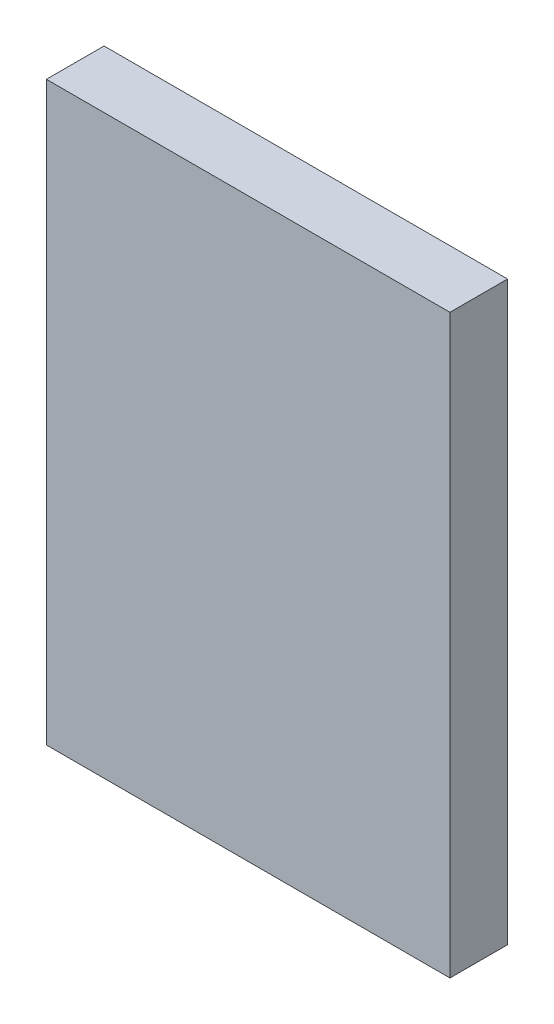
ISO-10303-21;
HEADER;
FILE_DESCRIPTION(('STEP AP214'),'2;1');
FILE_NAME('part.step','',(''),(''),'','','');
FILE_SCHEMA(('AUTOMOTIVE_DESIGN { 1 0 10303 214 1 1 1 1 }'));
ENDSEC;
DATA;
#1=APPLICATION_CONTEXT('core data for automotive mechanical design processes');
#2=APPLICATION_PROTOCOL_DEFINITION('international standard','automotive_design',2000,#1);
#3=PRODUCT_CONTEXT('',#1,'mechanical');
#4=PRODUCT('Part','Part','',(#3));
#5=PRODUCT_RELATED_PRODUCT_CATEGORY('part','',(#4));
#6=PRODUCT_DEFINITION_FORMATION('','',#4);
#7=PRODUCT_DEFINITION_CONTEXT('part definition',#1,'design');
#8=PRODUCT_DEFINITION('design','',#6,#7);
#9=PRODUCT_DEFINITION_SHAPE('','',#8);
#10=(LENGTH_UNIT() NAMED_UNIT(*) SI_UNIT(.MILLI.,.METRE.));
#11=(NAMED_UNIT(*) PLANE_ANGLE_UNIT() SI_UNIT($,.RADIAN.));
#12=(NAMED_UNIT(*) SI_UNIT($,.STERADIAN.) SOLID_ANGLE_UNIT());
#13=UNCERTAINTY_MEASURE_WITH_UNIT(LENGTH_MEASURE(1.E-05),#10,'distance_accuracy_value','');
#14=(GEOMETRIC_REPRESENTATION_CONTEXT(3) GLOBAL_UNCERTAINTY_ASSIGNED_CONTEXT((#13)) GLOBAL_UNIT_ASSIGNED_CONTEXT((#10,
#11,#12)) REPRESENTATION_CONTEXT('',''));
#15=CARTESIAN_POINT('',(0.,0.,0.));
#16=DIRECTION('',(0.,0.,1.));
#17=DIRECTION('',(1.,0.,0.));
#18=AXIS2_PLACEMENT_3D('',#15,#16,#17);
#19=CARTESIAN_POINT('',(350.,500.,50.));
#20=DIRECTION('',(-1.,0.,0.));
#21=DIRECTION('',(0.,-1.,0.));
#22=AXIS2_PLACEMENT_3D('',#19,#20,#21);
#23=PLANE('',#22);
#24=DIRECTION('',(0.,1.,0.));
#25=VECTOR('',#24,1.);
#26=CARTESIAN_POINT('',(350.,500.,-50.));
#27=LINE('',#26,#25);
#28=CARTESIAN_POINT('',(350.,-500.,-50.));
#29=VERTEX_POINT('',#28);
#30=CARTESIAN_POINT('',(350.,500.,-50.));
#31=VERTEX_POINT('',#30);
#32=EDGE_CURVE('E96',#29,#31,#27,.T.);
#33=ORIENTED_EDGE('',*,*,#32,.T.);
#34=DIRECTION('',(0.,0.,-1.));
#35=VECTOR('',#34,1.);
#36=CARTESIAN_POINT('',(350.,500.,50.));
#37=LINE('',#36,#35);
#38=CARTESIAN_POINT('',(350.,500.,50.));
#39=VERTEX_POINT('',#38);
#40=EDGE_CURVE('E11',#39,#31,#37,.T.);
#41=ORIENTED_EDGE('',*,*,#40,.F.);
#42=DIRECTION('',(0.,1.,0.));
#43=VECTOR('',#42,1.);
#44=CARTESIAN_POINT('',(350.,500.,50.));
#45=LINE('',#44,#43);
#46=CARTESIAN_POINT('',(350.,-500.,50.));
#47=VERTEX_POINT('',#46);
#48=EDGE_CURVE('E84',#47,#39,#45,.T.);
#49=ORIENTED_EDGE('',*,*,#48,.F.);
#50=DIRECTION('',(0.,0.,-1.));
#51=VECTOR('',#50,1.);
#52=CARTESIAN_POINT('',(350.,-500.,50.));
#53=LINE('',#52,#51);
#54=EDGE_CURVE('E92',#47,#29,#53,.T.);
#55=ORIENTED_EDGE('',*,*,#54,.T.);
#56=EDGE_LOOP('',(#33,#41,#49,#55));
#57=FACE_BOUND('',#56,.T.);
#58=ADVANCED_FACE('F33',(#57),#23,.F.);
#59=CARTESIAN_POINT('',(-350.,500.,50.));
#60=DIRECTION('',(0.,-1.,0.));
#61=DIRECTION('',(0.,0.,-1.));
#62=AXIS2_PLACEMENT_3D('',#59,#60,#61);
#63=PLANE('',#62);
#64=DIRECTION('',(-1.,0.,0.));
#65=VECTOR('',#64,1.);
#66=CARTESIAN_POINT('',(-350.,500.,-50.));
#67=LINE('',#66,#65);
#68=CARTESIAN_POINT('',(-350.,500.,-50.));
#69=VERTEX_POINT('',#68);
#70=EDGE_CURVE('E88',#31,#69,#67,.T.);
#71=ORIENTED_EDGE('',*,*,#70,.T.);
#72=DIRECTION('',(0.,0.,-1.));
#73=VECTOR('',#72,1.);
#74=CARTESIAN_POINT('',(-350.,500.,50.));
#75=LINE('',#74,#73);
#76=CARTESIAN_POINT('',(-350.,500.,50.));
#77=VERTEX_POINT('',#76);
#78=EDGE_CURVE('E41',#77,#69,#75,.T.);
#79=ORIENTED_EDGE('',*,*,#78,.F.);
#80=DIRECTION('',(-1.,0.,0.));
#81=VECTOR('',#80,1.);
#82=CARTESIAN_POINT('',(-350.,500.,50.));
#83=LINE('',#82,#81);
#84=EDGE_CURVE('E79',#39,#77,#83,.T.);
#85=ORIENTED_EDGE('',*,*,#84,.F.);
#86=ORIENTED_EDGE('',*,*,#40,.T.);
#87=EDGE_LOOP('',(#71,#79,#85,#86));
#88=FACE_BOUND('',#87,.T.);
#89=ADVANCED_FACE('F87',(#88),#63,.F.);
#90=CARTESIAN_POINT('',(-350.,500.,50.));
#91=DIRECTION('',(1.,0.,0.));
#92=DIRECTION('',(0.,1.,0.));
#93=AXIS2_PLACEMENT_3D('',#90,#91,#92);
#94=PLANE('',#93);
#95=DIRECTION('',(0.,-1.,0.));
#96=VECTOR('',#95,1.);
#97=CARTESIAN_POINT('',(-350.,500.,-50.));
#98=LINE('',#97,#96);
#99=CARTESIAN_POINT('',(-350.,-500.,-50.));
#100=VERTEX_POINT('',#99);
#101=EDGE_CURVE('E66',#69,#100,#98,.T.);
#102=ORIENTED_EDGE('',*,*,#101,.T.);
#103=DIRECTION('',(0.,0.,-1.));
#104=VECTOR('',#103,1.);
#105=CARTESIAN_POINT('',(-350.,-500.,50.));
#106=LINE('',#105,#104);
#107=CARTESIAN_POINT('',(-350.,-500.,50.));
#108=VERTEX_POINT('',#107);
#109=EDGE_CURVE('E89',#108,#100,#106,.T.);
#110=ORIENTED_EDGE('',*,*,#109,.F.);
#111=DIRECTION('',(0.,-1.,0.));
#112=VECTOR('',#111,1.);
#113=CARTESIAN_POINT('',(-350.,500.,50.));
#114=LINE('',#113,#112);
#115=EDGE_CURVE('E82',#77,#108,#114,.T.);
#116=ORIENTED_EDGE('',*,*,#115,.F.);
#117=ORIENTED_EDGE('',*,*,#78,.T.);
#118=EDGE_LOOP('',(#102,#110,#116,#117));
#119=FACE_BOUND('',#118,.T.);
#120=ADVANCED_FACE('F90',(#119),#94,.F.);
#121=CARTESIAN_POINT('',(-350.,-500.,50.));
#122=DIRECTION('',(0.,1.,0.));
#123=DIRECTION('',(0.,0.,1.));
#124=AXIS2_PLACEMENT_3D('',#121,#122,#123);
#125=PLANE('',#124);
#126=DIRECTION('',(1.,0.,0.));
#127=VECTOR('',#126,1.);
#128=CARTESIAN_POINT('',(-350.,-500.,-50.));
#129=LINE('',#128,#127);
#130=EDGE_CURVE('E72',#100,#29,#129,.T.);
#131=ORIENTED_EDGE('',*,*,#130,.T.);
#132=ORIENTED_EDGE('',*,*,#54,.F.);
#133=DIRECTION('',(1.,0.,0.));
#134=VECTOR('',#133,1.);
#135=CARTESIAN_POINT('',(-350.,-500.,50.));
#136=LINE('',#135,#134);
#137=EDGE_CURVE('E49',#108,#47,#136,.T.);
#138=ORIENTED_EDGE('',*,*,#137,.F.);
#139=ORIENTED_EDGE('',*,*,#109,.T.);
#140=EDGE_LOOP('',(#131,#132,#138,#139));
#141=FACE_BOUND('',#140,.T.);
#142=ADVANCED_FACE('F103',(#141),#125,.F.);
#143=CARTESIAN_POINT('',(0.,0.,50.));
#144=DIRECTION('',(0.,0.,1.));
#145=DIRECTION('',(1.,0.,0.));
#146=AXIS2_PLACEMENT_3D('',#143,#144,#145);
#147=PLANE('',#146);
#148=ORIENTED_EDGE('',*,*,#48,.T.);
#149=ORIENTED_EDGE('',*,*,#84,.T.);
#150=ORIENTED_EDGE('',*,*,#115,.T.);
#151=ORIENTED_EDGE('',*,*,#137,.T.);
#152=EDGE_LOOP('',(#148,#149,#150,#151));
#153=FACE_BOUND('',#152,.T.);
#154=ADVANCED_FACE('F80',(#153),#147,.T.);
#155=CARTESIAN_POINT('',(0.,0.,-50.));
#156=DIRECTION('',(0.,0.,1.));
#157=DIRECTION('',(1.,0.,0.));
#158=AXIS2_PLACEMENT_3D('',#155,#156,#157);
#159=PLANE('',#158);
#160=ORIENTED_EDGE('',*,*,#32,.F.);
#161=ORIENTED_EDGE('',*,*,#130,.F.);
#162=ORIENTED_EDGE('',*,*,#101,.F.);
#163=ORIENTED_EDGE('',*,*,#70,.F.);
#164=EDGE_LOOP('',(#160,#161,#162,#163));
#165=FACE_BOUND('',#164,.T.);
#166=ADVANCED_FACE('F106',(#165),#159,.F.);
#167=CLOSED_SHELL('',(#58,#89,#120,#142,#154,#166));
#168=MANIFOLD_SOLID_BREP('B2',#167);
#169=ADVANCED_BREP_SHAPE_REPRESENTATION('',(#18,#168),#14);
#170=SHAPE_DEFINITION_REPRESENTATION(#9,#169);
ENDSEC;
END-ISO-10303-21;
